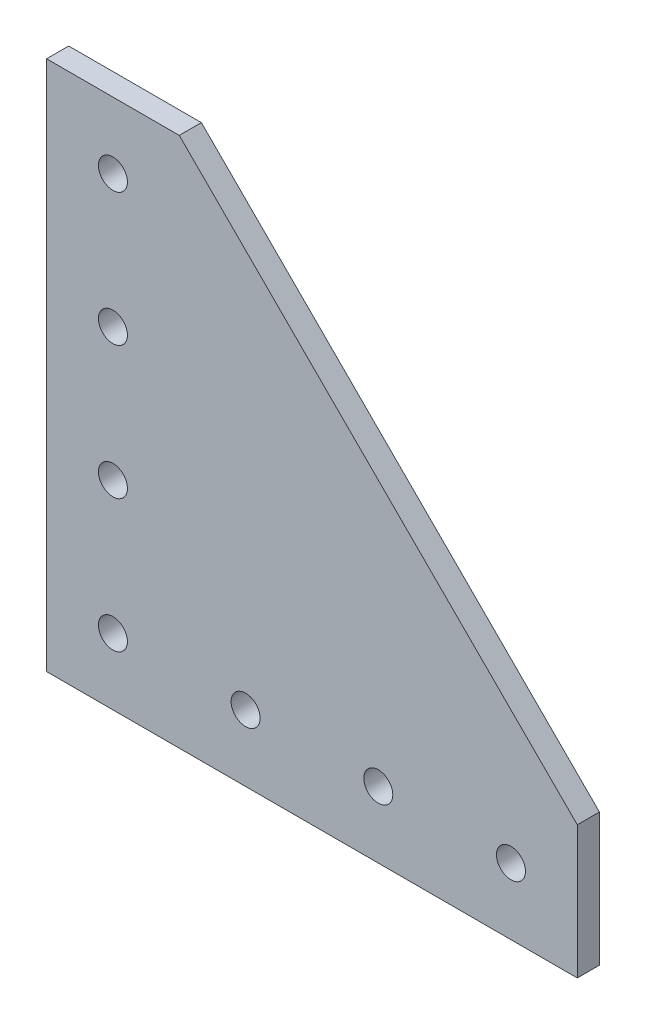
ISO-10303-21;
HEADER;
FILE_DESCRIPTION(('STEP AP214'),'2;1');
FILE_NAME('part.step','',(''),(''),'','','');
FILE_SCHEMA(('AUTOMOTIVE_DESIGN { 1 0 10303 214 1 1 1 1 }'));
ENDSEC;
DATA;
#1=APPLICATION_CONTEXT('core data for automotive mechanical design processes');
#2=APPLICATION_PROTOCOL_DEFINITION('international standard','automotive_design',2000,#1);
#3=PRODUCT_CONTEXT('',#1,'mechanical');
#4=PRODUCT('Part','Part','',(#3));
#5=PRODUCT_RELATED_PRODUCT_CATEGORY('part','',(#4));
#6=PRODUCT_DEFINITION_FORMATION('','',#4);
#7=PRODUCT_DEFINITION_CONTEXT('part definition',#1,'design');
#8=PRODUCT_DEFINITION('design','',#6,#7);
#9=PRODUCT_DEFINITION_SHAPE('','',#8);
#10=(LENGTH_UNIT() NAMED_UNIT(*) SI_UNIT(.MILLI.,.METRE.));
#11=(NAMED_UNIT(*) PLANE_ANGLE_UNIT() SI_UNIT($,.RADIAN.));
#12=(NAMED_UNIT(*) SI_UNIT($,.STERADIAN.) SOLID_ANGLE_UNIT());
#13=UNCERTAINTY_MEASURE_WITH_UNIT(LENGTH_MEASURE(1.E-05),#10,'distance_accuracy_value','');
#14=(GEOMETRIC_REPRESENTATION_CONTEXT(3) GLOBAL_UNCERTAINTY_ASSIGNED_CONTEXT((#13)) GLOBAL_UNIT_ASSIGNED_CONTEXT((#10,
#11,#12)) REPRESENTATION_CONTEXT('',''));
#15=CARTESIAN_POINT('',(0.,0.,0.));
#16=DIRECTION('',(0.,0.,1.));
#17=DIRECTION('',(1.,0.,0.));
#18=AXIS2_PLACEMENT_3D('',#15,#16,#17);
#19=CARTESIAN_POINT('',(-38.1,76.2,-3.175));
#20=DIRECTION('',(0.707106781186548,0.707106781186548,0.));
#21=DIRECTION('',(-0.707106781186548,0.707106781186548,0.));
#22=AXIS2_PLACEMENT_3D('',#19,#20,#21);
#23=PLANE('',#22);
#24=DIRECTION('',(0.,0.,1.));
#25=VECTOR('',#24,1.);
#26=CARTESIAN_POINT('',(-38.1,76.2,-3.175));
#27=LINE('',#26,#25);
#28=CARTESIAN_POINT('',(-38.1,76.2,-3.175));
#29=VERTEX_POINT('',#28);
#30=CARTESIAN_POINT('',(-38.1,76.2,3.175));
#31=VERTEX_POINT('',#30);
#32=EDGE_CURVE('E35',#29,#31,#27,.T.);
#33=ORIENTED_EDGE('',*,*,#32,.T.);
#34=DIRECTION('',(-0.707106781186548,0.707106781186548,0.));
#35=VECTOR('',#34,1.);
#36=CARTESIAN_POINT('',(-38.1,76.2,3.175));
#37=LINE('',#36,#35);
#38=CARTESIAN_POINT('',(76.2,-38.1,3.175));
#39=VERTEX_POINT('',#38);
#40=EDGE_CURVE('E78',#39,#31,#37,.T.);
#41=ORIENTED_EDGE('',*,*,#40,.F.);
#42=DIRECTION('',(0.,0.,1.));
#43=VECTOR('',#42,1.);
#44=CARTESIAN_POINT('',(76.2,-38.1,-3.175));
#45=LINE('',#44,#43);
#46=CARTESIAN_POINT('',(76.2,-38.1,-3.175));
#47=VERTEX_POINT('',#46);
#48=EDGE_CURVE('E11',#47,#39,#45,.T.);
#49=ORIENTED_EDGE('',*,*,#48,.F.);
#50=DIRECTION('',(-0.707106781186548,0.707106781186548,0.));
#51=VECTOR('',#50,1.);
#52=CARTESIAN_POINT('',(-38.1,76.2,-3.175));
#53=LINE('',#52,#51);
#54=EDGE_CURVE('E79',#47,#29,#53,.T.);
#55=ORIENTED_EDGE('',*,*,#54,.T.);
#56=EDGE_LOOP('',(#33,#41,#49,#55));
#57=FACE_BOUND('',#56,.T.);
#58=ADVANCED_FACE('F32',(#57),#23,.T.);
#59=CARTESIAN_POINT('',(76.2,-38.1,-3.175));
#60=DIRECTION('',(1.,0.,0.));
#61=DIRECTION('',(0.,1.,0.));
#62=AXIS2_PLACEMENT_3D('',#59,#60,#61);
#63=PLANE('',#62);
#64=ORIENTED_EDGE('',*,*,#48,.T.);
#65=DIRECTION('',(0.,1.,0.));
#66=VECTOR('',#65,1.);
#67=CARTESIAN_POINT('',(76.2,-38.1,3.175));
#68=LINE('',#67,#66);
#69=CARTESIAN_POINT('',(76.2,-76.2,3.175));
#70=VERTEX_POINT('',#69);
#71=EDGE_CURVE('E96',#70,#39,#68,.T.);
#72=ORIENTED_EDGE('',*,*,#71,.F.);
#73=DIRECTION('',(0.,0.,1.));
#74=VECTOR('',#73,1.);
#75=CARTESIAN_POINT('',(76.2,-76.2,-3.175));
#76=LINE('',#75,#74);
#77=CARTESIAN_POINT('',(76.2,-76.2,-3.175));
#78=VERTEX_POINT('',#77);
#79=EDGE_CURVE('E40',#78,#70,#76,.T.);
#80=ORIENTED_EDGE('',*,*,#79,.F.);
#81=DIRECTION('',(0.,1.,0.));
#82=VECTOR('',#81,1.);
#83=CARTESIAN_POINT('',(76.2,-38.1,-3.175));
#84=LINE('',#83,#82);
#85=EDGE_CURVE('E84',#78,#47,#84,.T.);
#86=ORIENTED_EDGE('',*,*,#85,.T.);
#87=EDGE_LOOP('',(#64,#72,#80,#86));
#88=FACE_BOUND('',#87,.T.);
#89=ADVANCED_FACE('F129',(#88),#63,.T.);
#90=CARTESIAN_POINT('',(76.2,-76.2,-3.175));
#91=DIRECTION('',(0.,-1.,0.));
#92=DIRECTION('',(1.,0.,0.));
#93=AXIS2_PLACEMENT_3D('',#90,#91,#92);
#94=PLANE('',#93);
#95=ORIENTED_EDGE('',*,*,#79,.T.);
#96=DIRECTION('',(1.,0.,0.));
#97=VECTOR('',#96,1.);
#98=CARTESIAN_POINT('',(76.2,-76.2,3.175));
#99=LINE('',#98,#97);
#100=CARTESIAN_POINT('',(-76.2,-76.2,3.175));
#101=VERTEX_POINT('',#100);
#102=EDGE_CURVE('E105',#101,#70,#99,.T.);
#103=ORIENTED_EDGE('',*,*,#102,.F.);
#104=DIRECTION('',(0.,0.,1.));
#105=VECTOR('',#104,1.);
#106=CARTESIAN_POINT('',(-76.2,-76.2,-3.175));
#107=LINE('',#106,#105);
#108=CARTESIAN_POINT('',(-76.2,-76.2,-3.175));
#109=VERTEX_POINT('',#108);
#110=EDGE_CURVE('E118',#109,#101,#107,.T.);
#111=ORIENTED_EDGE('',*,*,#110,.F.);
#112=DIRECTION('',(1.,0.,0.));
#113=VECTOR('',#112,1.);
#114=CARTESIAN_POINT('',(76.2,-76.2,-3.175));
#115=LINE('',#114,#113);
#116=EDGE_CURVE('E114',#109,#78,#115,.T.);
#117=ORIENTED_EDGE('',*,*,#116,.T.);
#118=EDGE_LOOP('',(#95,#103,#111,#117));
#119=FACE_BOUND('',#118,.T.);
#120=ADVANCED_FACE('F125',(#119),#94,.T.);
#121=CARTESIAN_POINT('',(-76.2,-76.2,-3.175));
#122=DIRECTION('',(-1.,0.,0.));
#123=DIRECTION('',(0.,-1.,0.));
#124=AXIS2_PLACEMENT_3D('',#121,#122,#123);
#125=PLANE('',#124);
#126=ORIENTED_EDGE('',*,*,#110,.T.);
#127=DIRECTION('',(0.,-1.,0.));
#128=VECTOR('',#127,1.);
#129=CARTESIAN_POINT('',(-76.2,-76.2,3.175));
#130=LINE('',#129,#128);
#131=CARTESIAN_POINT('',(-76.2,76.2,3.175));
#132=VERTEX_POINT('',#131);
#133=EDGE_CURVE('E91',#132,#101,#130,.T.);
#134=ORIENTED_EDGE('',*,*,#133,.F.);
#135=DIRECTION('',(0.,0.,1.));
#136=VECTOR('',#135,1.);
#137=CARTESIAN_POINT('',(-76.2,76.2,-3.175));
#138=LINE('',#137,#136);
#139=CARTESIAN_POINT('',(-76.2,76.2,-3.175));
#140=VERTEX_POINT('',#139);
#141=EDGE_CURVE('E83',#140,#132,#138,.T.);
#142=ORIENTED_EDGE('',*,*,#141,.F.);
#143=DIRECTION('',(0.,-1.,0.));
#144=VECTOR('',#143,1.);
#145=CARTESIAN_POINT('',(-76.2,-76.2,-3.175));
#146=LINE('',#145,#144);
#147=EDGE_CURVE('E111',#140,#109,#146,.T.);
#148=ORIENTED_EDGE('',*,*,#147,.T.);
#149=EDGE_LOOP('',(#126,#134,#142,#148));
#150=FACE_BOUND('',#149,.T.);
#151=ADVANCED_FACE('F120',(#150),#125,.T.);
#152=CARTESIAN_POINT('',(-76.2,76.2,-3.175));
#153=DIRECTION('',(0.,1.,0.));
#154=DIRECTION('',(0.,0.,1.));
#155=AXIS2_PLACEMENT_3D('',#152,#153,#154);
#156=PLANE('',#155);
#157=ORIENTED_EDGE('',*,*,#141,.T.);
#158=DIRECTION('',(-1.,0.,0.));
#159=VECTOR('',#158,1.);
#160=CARTESIAN_POINT('',(-76.2,76.2,3.175));
#161=LINE('',#160,#159);
#162=EDGE_CURVE('E86',#31,#132,#161,.T.);
#163=ORIENTED_EDGE('',*,*,#162,.F.);
#164=ORIENTED_EDGE('',*,*,#32,.F.);
#165=DIRECTION('',(-1.,0.,0.));
#166=VECTOR('',#165,1.);
#167=CARTESIAN_POINT('',(-76.2,76.2,-3.175));
#168=LINE('',#167,#166);
#169=EDGE_CURVE('E109',#29,#140,#168,.T.);
#170=ORIENTED_EDGE('',*,*,#169,.T.);
#171=EDGE_LOOP('',(#157,#163,#164,#170));
#172=FACE_BOUND('',#171,.T.);
#173=ADVANCED_FACE('F87',(#172),#156,.T.);
#174=CARTESIAN_POINT('',(0.,0.,-3.175));
#175=DIRECTION('',(0.,0.,-1.));
#176=DIRECTION('',(-1.,0.,0.));
#177=AXIS2_PLACEMENT_3D('',#174,#175,#176);
#178=PLANE('',#177);
#179=CARTESIAN_POINT('',(-19.05,-57.15,-3.175));
#180=DIRECTION('',(0.,0.,1.));
#181=DIRECTION('',(1.,0.,0.));
#182=AXIS2_PLACEMENT_3D('',#179,#180,#181);
#183=CIRCLE('',#182,4.16560000000001);
#184=CARTESIAN_POINT('',(-14.8844,-57.15,-3.175));
#185=VERTEX_POINT('',#184);
#186=EDGE_CURVE('E154',#185,#185,#183,.T.);
#187=ORIENTED_EDGE('',*,*,#186,.T.);
#188=EDGE_LOOP('',(#187));
#189=FACE_BOUND('',#188,.T.);
#190=CARTESIAN_POINT('',(19.05,-57.15,-3.175));
#191=DIRECTION('',(0.,0.,1.));
#192=DIRECTION('',(1.,0.,0.));
#193=AXIS2_PLACEMENT_3D('',#190,#191,#192);
#194=CIRCLE('',#193,4.16560000000001);
#195=CARTESIAN_POINT('',(23.2156,-57.15,-3.175));
#196=VERTEX_POINT('',#195);
#197=EDGE_CURVE('E158',#196,#196,#194,.T.);
#198=ORIENTED_EDGE('',*,*,#197,.T.);
#199=EDGE_LOOP('',(#198));
#200=FACE_BOUND('',#199,.T.);
#201=CARTESIAN_POINT('',(-57.1500000000001,-19.05,-3.175));
#202=DIRECTION('',(0.,0.,1.));
#203=DIRECTION('',(1.,0.,0.));
#204=AXIS2_PLACEMENT_3D('',#201,#202,#203);
#205=CIRCLE('',#204,4.16560000000001);
#206=CARTESIAN_POINT('',(-52.9844000000001,-19.05,-3.175));
#207=VERTEX_POINT('',#206);
#208=EDGE_CURVE('E162',#207,#207,#205,.T.);
#209=ORIENTED_EDGE('',*,*,#208,.T.);
#210=EDGE_LOOP('',(#209));
#211=FACE_BOUND('',#210,.T.);
#212=CARTESIAN_POINT('',(-57.1500000000003,19.05,-3.175));
#213=DIRECTION('',(0.,0.,1.));
#214=DIRECTION('',(1.,0.,0.));
#215=AXIS2_PLACEMENT_3D('',#212,#213,#214);
#216=CIRCLE('',#215,4.16560000000001);
#217=CARTESIAN_POINT('',(-52.9844000000003,19.05,-3.175));
#218=VERTEX_POINT('',#217);
#219=EDGE_CURVE('E166',#218,#218,#216,.T.);
#220=ORIENTED_EDGE('',*,*,#219,.T.);
#221=EDGE_LOOP('',(#220));
#222=FACE_BOUND('',#221,.T.);
#223=CARTESIAN_POINT('',(57.15,-57.15,-3.175));
#224=DIRECTION('',(0.,0.,1.));
#225=DIRECTION('',(1.,0.,0.));
#226=AXIS2_PLACEMENT_3D('',#223,#224,#225);
#227=CIRCLE('',#226,4.16560000000001);
#228=CARTESIAN_POINT('',(61.3156,-57.15,-3.175));
#229=VERTEX_POINT('',#228);
#230=EDGE_CURVE('E170',#229,#229,#227,.T.);
#231=ORIENTED_EDGE('',*,*,#230,.T.);
#232=EDGE_LOOP('',(#231));
#233=FACE_BOUND('',#232,.T.);
#234=CARTESIAN_POINT('',(-57.1500000000004,57.15,-3.175));
#235=DIRECTION('',(0.,0.,1.));
#236=DIRECTION('',(1.,0.,0.));
#237=AXIS2_PLACEMENT_3D('',#234,#235,#236);
#238=CIRCLE('',#237,4.16560000000001);
#239=CARTESIAN_POINT('',(-52.9844000000004,57.15,-3.175));
#240=VERTEX_POINT('',#239);
#241=EDGE_CURVE('E174',#240,#240,#238,.T.);
#242=ORIENTED_EDGE('',*,*,#241,.T.);
#243=EDGE_LOOP('',(#242));
#244=FACE_BOUND('',#243,.T.);
#245=CARTESIAN_POINT('',(-57.15,-57.15,-3.175));
#246=DIRECTION('',(0.,0.,1.));
#247=DIRECTION('',(1.,0.,0.));
#248=AXIS2_PLACEMENT_3D('',#245,#246,#247);
#249=CIRCLE('',#248,4.16560000000001);
#250=CARTESIAN_POINT('',(-52.9844,-57.15,-3.175));
#251=VERTEX_POINT('',#250);
#252=EDGE_CURVE('E97',#251,#251,#249,.T.);
#253=ORIENTED_EDGE('',*,*,#252,.T.);
#254=EDGE_LOOP('',(#253));
#255=FACE_BOUND('',#254,.T.);
#256=ORIENTED_EDGE('',*,*,#54,.F.);
#257=ORIENTED_EDGE('',*,*,#85,.F.);
#258=ORIENTED_EDGE('',*,*,#116,.F.);
#259=ORIENTED_EDGE('',*,*,#147,.F.);
#260=ORIENTED_EDGE('',*,*,#169,.F.);
#261=EDGE_LOOP('',(#256,#257,#258,#259,#260));
#262=FACE_BOUND('',#261,.T.);
#263=ADVANCED_FACE('F128',(#189,#200,#211,#222,#233,#244,#255,#262),#178,.T.);
#264=CARTESIAN_POINT('',(0.,0.,3.175));
#265=DIRECTION('',(0.,0.,-1.));
#266=DIRECTION('',(-1.,0.,0.));
#267=AXIS2_PLACEMENT_3D('',#264,#265,#266);
#268=PLANE('',#267);
#269=CARTESIAN_POINT('',(-19.05,-57.15,3.175));
#270=DIRECTION('',(0.,0.,1.));
#271=DIRECTION('',(1.,0.,0.));
#272=AXIS2_PLACEMENT_3D('',#269,#270,#271);
#273=CIRCLE('',#272,4.16560000000001);
#274=CARTESIAN_POINT('',(-14.8844,-57.15,3.175));
#275=VERTEX_POINT('',#274);
#276=EDGE_CURVE('E184',#275,#275,#273,.T.);
#277=ORIENTED_EDGE('',*,*,#276,.F.);
#278=EDGE_LOOP('',(#277));
#279=FACE_BOUND('',#278,.T.);
#280=CARTESIAN_POINT('',(19.05,-57.15,3.175));
#281=DIRECTION('',(0.,0.,1.));
#282=DIRECTION('',(1.,0.,0.));
#283=AXIS2_PLACEMENT_3D('',#280,#281,#282);
#284=CIRCLE('',#283,4.16560000000001);
#285=CARTESIAN_POINT('',(23.2156,-57.15,3.175));
#286=VERTEX_POINT('',#285);
#287=EDGE_CURVE('E193',#286,#286,#284,.T.);
#288=ORIENTED_EDGE('',*,*,#287,.F.);
#289=EDGE_LOOP('',(#288));
#290=FACE_BOUND('',#289,.T.);
#291=CARTESIAN_POINT('',(-57.1500000000001,-19.05,3.175));
#292=DIRECTION('',(0.,0.,1.));
#293=DIRECTION('',(1.,0.,0.));
#294=AXIS2_PLACEMENT_3D('',#291,#292,#293);
#295=CIRCLE('',#294,4.16560000000001);
#296=CARTESIAN_POINT('',(-52.9844000000001,-19.05,3.175));
#297=VERTEX_POINT('',#296);
#298=EDGE_CURVE('E197',#297,#297,#295,.T.);
#299=ORIENTED_EDGE('',*,*,#298,.F.);
#300=EDGE_LOOP('',(#299));
#301=FACE_BOUND('',#300,.T.);
#302=CARTESIAN_POINT('',(-57.1500000000003,19.05,3.175));
#303=DIRECTION('',(0.,0.,1.));
#304=DIRECTION('',(1.,0.,0.));
#305=AXIS2_PLACEMENT_3D('',#302,#303,#304);
#306=CIRCLE('',#305,4.16560000000001);
#307=CARTESIAN_POINT('',(-52.9844000000003,19.05,3.175));
#308=VERTEX_POINT('',#307);
#309=EDGE_CURVE('E201',#308,#308,#306,.T.);
#310=ORIENTED_EDGE('',*,*,#309,.F.);
#311=EDGE_LOOP('',(#310));
#312=FACE_BOUND('',#311,.T.);
#313=CARTESIAN_POINT('',(57.15,-57.15,3.175));
#314=DIRECTION('',(0.,0.,1.));
#315=DIRECTION('',(1.,0.,0.));
#316=AXIS2_PLACEMENT_3D('',#313,#314,#315);
#317=CIRCLE('',#316,4.16560000000001);
#318=CARTESIAN_POINT('',(61.3156,-57.15,3.175));
#319=VERTEX_POINT('',#318);
#320=EDGE_CURVE('E205',#319,#319,#317,.T.);
#321=ORIENTED_EDGE('',*,*,#320,.F.);
#322=EDGE_LOOP('',(#321));
#323=FACE_BOUND('',#322,.T.);
#324=CARTESIAN_POINT('',(-57.1500000000004,57.15,3.175));
#325=DIRECTION('',(0.,0.,1.));
#326=DIRECTION('',(1.,0.,0.));
#327=AXIS2_PLACEMENT_3D('',#324,#325,#326);
#328=CIRCLE('',#327,4.16560000000001);
#329=CARTESIAN_POINT('',(-52.9844000000004,57.15,3.175));
#330=VERTEX_POINT('',#329);
#331=EDGE_CURVE('E189',#330,#330,#328,.T.);
#332=ORIENTED_EDGE('',*,*,#331,.F.);
#333=EDGE_LOOP('',(#332));
#334=FACE_BOUND('',#333,.T.);
#335=CARTESIAN_POINT('',(-57.15,-57.15,3.175));
#336=DIRECTION('',(0.,0.,1.));
#337=DIRECTION('',(1.,0.,0.));
#338=AXIS2_PLACEMENT_3D('',#335,#336,#337);
#339=CIRCLE('',#338,4.16560000000001);
#340=CARTESIAN_POINT('',(-52.9844,-57.15,3.175));
#341=VERTEX_POINT('',#340);
#342=EDGE_CURVE('E100',#341,#341,#339,.T.);
#343=ORIENTED_EDGE('',*,*,#342,.F.);
#344=EDGE_LOOP('',(#343));
#345=FACE_BOUND('',#344,.T.);
#346=ORIENTED_EDGE('',*,*,#40,.T.);
#347=ORIENTED_EDGE('',*,*,#162,.T.);
#348=ORIENTED_EDGE('',*,*,#133,.T.);
#349=ORIENTED_EDGE('',*,*,#102,.T.);
#350=ORIENTED_EDGE('',*,*,#71,.T.);
#351=EDGE_LOOP('',(#346,#347,#348,#349,#350));
#352=FACE_BOUND('',#351,.T.);
#353=ADVANCED_FACE('F94',(#279,#290,#301,#312,#323,#334,#345,#352),#268,.F.);
#354=CARTESIAN_POINT('',(-57.15,-57.15,-3.175));
#355=DIRECTION('',(0.,0.,1.));
#356=DIRECTION('',(1.,0.,0.));
#357=AXIS2_PLACEMENT_3D('',#354,#355,#356);
#358=CYLINDRICAL_SURFACE('',#357,4.16560000000001);
#359=ORIENTED_EDGE('',*,*,#252,.F.);
#360=EDGE_LOOP('',(#359));
#361=FACE_BOUND('',#360,.T.);
#362=ORIENTED_EDGE('',*,*,#342,.T.);
#363=EDGE_LOOP('',(#362));
#364=FACE_BOUND('',#363,.T.);
#365=ADVANCED_FACE('F149',(#361,#364),#358,.F.);
#366=CARTESIAN_POINT('',(-57.1500000000004,57.15,-3.175));
#367=DIRECTION('',(0.,0.,1.));
#368=DIRECTION('',(1.,0.,0.));
#369=AXIS2_PLACEMENT_3D('',#366,#367,#368);
#370=CYLINDRICAL_SURFACE('',#369,4.16560000000001);
#371=ORIENTED_EDGE('',*,*,#241,.F.);
#372=EDGE_LOOP('',(#371));
#373=FACE_BOUND('',#372,.T.);
#374=ORIENTED_EDGE('',*,*,#331,.T.);
#375=EDGE_LOOP('',(#374));
#376=FACE_BOUND('',#375,.T.);
#377=ADVANCED_FACE('F179',(#373,#376),#370,.F.);
#378=CARTESIAN_POINT('',(57.15,-57.15,-3.175));
#379=DIRECTION('',(0.,0.,1.));
#380=DIRECTION('',(1.,0.,0.));
#381=AXIS2_PLACEMENT_3D('',#378,#379,#380);
#382=CYLINDRICAL_SURFACE('',#381,4.16560000000001);
#383=ORIENTED_EDGE('',*,*,#230,.F.);
#384=EDGE_LOOP('',(#383));
#385=FACE_BOUND('',#384,.T.);
#386=ORIENTED_EDGE('',*,*,#320,.T.);
#387=EDGE_LOOP('',(#386));
#388=FACE_BOUND('',#387,.T.);
#389=ADVANCED_FACE('F214',(#385,#388),#382,.F.);
#390=CARTESIAN_POINT('',(-57.1500000000003,19.05,-3.175));
#391=DIRECTION('',(0.,0.,1.));
#392=DIRECTION('',(1.,0.,0.));
#393=AXIS2_PLACEMENT_3D('',#390,#391,#392);
#394=CYLINDRICAL_SURFACE('',#393,4.16560000000001);
#395=ORIENTED_EDGE('',*,*,#219,.F.);
#396=EDGE_LOOP('',(#395));
#397=FACE_BOUND('',#396,.T.);
#398=ORIENTED_EDGE('',*,*,#309,.T.);
#399=EDGE_LOOP('',(#398));
#400=FACE_BOUND('',#399,.T.);
#401=ADVANCED_FACE('F220',(#397,#400),#394,.F.);
#402=CARTESIAN_POINT('',(-57.1500000000001,-19.05,-3.175));
#403=DIRECTION('',(0.,0.,1.));
#404=DIRECTION('',(1.,0.,0.));
#405=AXIS2_PLACEMENT_3D('',#402,#403,#404);
#406=CYLINDRICAL_SURFACE('',#405,4.16560000000001);
#407=ORIENTED_EDGE('',*,*,#208,.F.);
#408=EDGE_LOOP('',(#407));
#409=FACE_BOUND('',#408,.T.);
#410=ORIENTED_EDGE('',*,*,#298,.T.);
#411=EDGE_LOOP('',(#410));
#412=FACE_BOUND('',#411,.T.);
#413=ADVANCED_FACE('F231',(#409,#412),#406,.F.);
#414=CARTESIAN_POINT('',(19.05,-57.15,-3.175));
#415=DIRECTION('',(0.,0.,1.));
#416=DIRECTION('',(1.,0.,0.));
#417=AXIS2_PLACEMENT_3D('',#414,#415,#416);
#418=CYLINDRICAL_SURFACE('',#417,4.16560000000001);
#419=ORIENTED_EDGE('',*,*,#197,.F.);
#420=EDGE_LOOP('',(#419));
#421=FACE_BOUND('',#420,.T.);
#422=ORIENTED_EDGE('',*,*,#287,.T.);
#423=EDGE_LOOP('',(#422));
#424=FACE_BOUND('',#423,.T.);
#425=ADVANCED_FACE('F227',(#421,#424),#418,.F.);
#426=CARTESIAN_POINT('',(-19.05,-57.15,-3.175));
#427=DIRECTION('',(0.,0.,1.));
#428=DIRECTION('',(1.,0.,0.));
#429=AXIS2_PLACEMENT_3D('',#426,#427,#428);
#430=CYLINDRICAL_SURFACE('',#429,4.16560000000001);
#431=ORIENTED_EDGE('',*,*,#186,.F.);
#432=EDGE_LOOP('',(#431));
#433=FACE_BOUND('',#432,.T.);
#434=ORIENTED_EDGE('',*,*,#276,.T.);
#435=EDGE_LOOP('',(#434));
#436=FACE_BOUND('',#435,.T.);
#437=ADVANCED_FACE('F224',(#433,#436),#430,.F.);
#438=CLOSED_SHELL('',(#58,#89,#120,#151,#173,#263,#353,#365,#377,#389,#401,#413,#425,#437));
#439=MANIFOLD_SOLID_BREP('B2',#438);
#440=ADVANCED_BREP_SHAPE_REPRESENTATION('',(#18,#439),#14);
#441=SHAPE_DEFINITION_REPRESENTATION(#9,#440);
ENDSEC;
END-ISO-10303-21;
